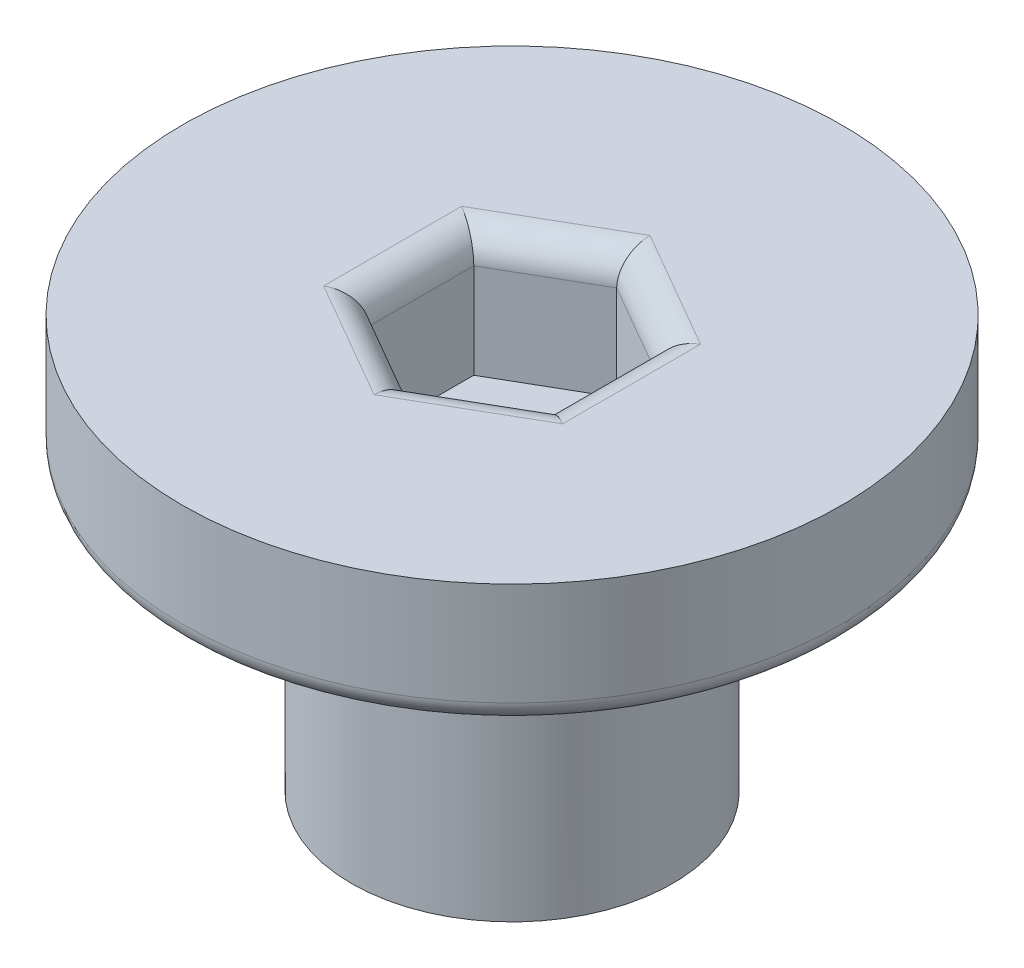
ISO-10303-21;
HEADER;
FILE_DESCRIPTION(('STEP AP214'),'2;1');
FILE_NAME('part.step','',(''),(''),'','','');
FILE_SCHEMA(('AUTOMOTIVE_DESIGN { 1 0 10303 214 1 1 1 1 }'));
ENDSEC;
DATA;
#1=APPLICATION_CONTEXT('core data for automotive mechanical design processes');
#2=APPLICATION_PROTOCOL_DEFINITION('international standard','automotive_design',2000,#1);
#3=PRODUCT_CONTEXT('',#1,'mechanical');
#4=PRODUCT('Part','Part','',(#3));
#5=PRODUCT_RELATED_PRODUCT_CATEGORY('part','',(#4));
#6=PRODUCT_DEFINITION_FORMATION('','',#4);
#7=PRODUCT_DEFINITION_CONTEXT('part definition',#1,'design');
#8=PRODUCT_DEFINITION('design','',#6,#7);
#9=PRODUCT_DEFINITION_SHAPE('','',#8);
#10=(LENGTH_UNIT() NAMED_UNIT(*) SI_UNIT(.MILLI.,.METRE.));
#11=(NAMED_UNIT(*) PLANE_ANGLE_UNIT() SI_UNIT($,.RADIAN.));
#12=(NAMED_UNIT(*) SI_UNIT($,.STERADIAN.) SOLID_ANGLE_UNIT());
#13=UNCERTAINTY_MEASURE_WITH_UNIT(LENGTH_MEASURE(1.E-05),#10,'distance_accuracy_value','');
#14=(GEOMETRIC_REPRESENTATION_CONTEXT(3) GLOBAL_UNCERTAINTY_ASSIGNED_CONTEXT((#13)) GLOBAL_UNIT_ASSIGNED_CONTEXT((#10,
#11,#12)) REPRESENTATION_CONTEXT('',''));
#15=CARTESIAN_POINT('',(0.,0.,0.));
#16=DIRECTION('',(0.,0.,1.));
#17=DIRECTION('',(1.,0.,0.));
#18=AXIS2_PLACEMENT_3D('',#15,#16,#17);
#19=CARTESIAN_POINT('',(0.,5.,0.));
#20=DIRECTION('',(0.,-1.,0.));
#21=DIRECTION('',(0.,0.,-1.));
#22=AXIS2_PLACEMENT_3D('',#19,#20,#21);
#23=CYLINDRICAL_SURFACE('',#22,1.15);
#24=CARTESIAN_POINT('',(0.,-6.5,0.));
#25=DIRECTION('',(0.,-1.,0.));
#26=DIRECTION('',(0.,0.,-1.));
#27=AXIS2_PLACEMENT_3D('',#24,#25,#26);
#28=CIRCLE('',#27,1.15);
#29=CARTESIAN_POINT('',(0.,-6.5,-1.15));
#30=VERTEX_POINT('',#29);
#31=EDGE_CURVE('E186',#30,#30,#28,.T.);
#32=ORIENTED_EDGE('',*,*,#31,.T.);
#33=EDGE_LOOP('',(#32));
#34=FACE_BOUND('',#33,.T.);
#35=CARTESIAN_POINT('',(0.,0.,0.));
#36=DIRECTION('',(0.,1.,0.));
#37=DIRECTION('',(0.,0.,1.));
#38=AXIS2_PLACEMENT_3D('',#35,#36,#37);
#39=CIRCLE('',#38,1.15);
#40=CARTESIAN_POINT('',(0.,0.,1.15));
#41=VERTEX_POINT('',#40);
#42=EDGE_CURVE('E143',#41,#41,#39,.F.);
#43=ORIENTED_EDGE('',*,*,#42,.F.);
#44=EDGE_LOOP('',(#43));
#45=FACE_BOUND('',#44,.T.);
#46=ADVANCED_FACE('F37',(#34,#45),#23,.F.);
#47=CARTESIAN_POINT('',(0.,3.,0.));
#48=DIRECTION('',(0.,-1.,0.));
#49=DIRECTION('',(0.,0.,-1.));
#50=AXIS2_PLACEMENT_3D('',#47,#48,#49);
#51=CYLINDRICAL_SURFACE('',#50,8.);
#52=CARTESIAN_POINT('',(0.,0.5,0.));
#53=DIRECTION('',(0.,1.,0.));
#54=DIRECTION('',(0.,0.,1.));
#55=AXIS2_PLACEMENT_3D('',#52,#53,#54);
#56=CIRCLE('',#55,8.);
#57=CARTESIAN_POINT('',(0.,0.5,8.));
#58=VERTEX_POINT('',#57);
#59=EDGE_CURVE('E204',#58,#58,#56,.T.);
#60=ORIENTED_EDGE('',*,*,#59,.T.);
#61=EDGE_LOOP('',(#60));
#62=FACE_BOUND('',#61,.T.);
#63=CARTESIAN_POINT('',(0.,3.,0.));
#64=DIRECTION('',(0.,1.,0.));
#65=DIRECTION('',(0.,0.,1.));
#66=AXIS2_PLACEMENT_3D('',#63,#64,#65);
#67=CIRCLE('',#66,8.);
#68=CARTESIAN_POINT('',(0.,3.,8.));
#69=VERTEX_POINT('',#68);
#70=EDGE_CURVE('E157',#69,#69,#67,.T.);
#71=ORIENTED_EDGE('',*,*,#70,.F.);
#72=EDGE_LOOP('',(#71));
#73=FACE_BOUND('',#72,.T.);
#74=ADVANCED_FACE('F221',(#62,#73),#51,.T.);
#75=CARTESIAN_POINT('',(0.,3.,0.));
#76=DIRECTION('',(0.,1.,0.));
#77=DIRECTION('',(0.,0.,1.));
#78=AXIS2_PLACEMENT_3D('',#75,#76,#77);
#79=PLANE('',#78);
#80=DIRECTION('',(-0.866025403784439,0.,-0.5));
#81=VECTOR('',#80,1.);
#82=CARTESIAN_POINT('',(2.55,3.,-1.87638837486629));
#83=LINE('',#82,#81);
#84=CARTESIAN_POINT('',(0.,3.,-3.34863156129983));
#85=VERTEX_POINT('',#84);
#86=CARTESIAN_POINT('',(2.9,3.,-1.67431578064992));
#87=VERTEX_POINT('',#86);
#88=EDGE_CURVE('E165',#85,#87,#83,.F.);
#89=ORIENTED_EDGE('',*,*,#88,.T.);
#90=DIRECTION('',(0.,0.,-1.));
#91=VECTOR('',#90,1.);
#92=CARTESIAN_POINT('',(2.9,3.,1.27017059221718));
#93=LINE('',#92,#91);
#94=CARTESIAN_POINT('',(2.9,3.,1.67431578064992));
#95=VERTEX_POINT('',#94);
#96=EDGE_CURVE('E175',#87,#95,#93,.F.);
#97=ORIENTED_EDGE('',*,*,#96,.T.);
#98=DIRECTION('',(0.866025403784439,0.,-0.5));
#99=VECTOR('',#98,1.);
#100=CARTESIAN_POINT('',(0.35,3.,3.14655896708346));
#101=LINE('',#100,#99);
#102=CARTESIAN_POINT('',(0.,3.,3.34863156129983));
#103=VERTEX_POINT('',#102);
#104=EDGE_CURVE('E173',#95,#103,#101,.F.);
#105=ORIENTED_EDGE('',*,*,#104,.T.);
#106=DIRECTION('',(0.866025403784439,0.,0.5));
#107=VECTOR('',#106,1.);
#108=CARTESIAN_POINT('',(-2.55,3.,1.87638837486628));
#109=LINE('',#108,#107);
#110=CARTESIAN_POINT('',(-2.9,3.,1.67431578064992));
#111=VERTEX_POINT('',#110);
#112=EDGE_CURVE('E171',#103,#111,#109,.F.);
#113=ORIENTED_EDGE('',*,*,#112,.T.);
#114=DIRECTION('',(0.,0.,1.));
#115=VECTOR('',#114,1.);
#116=CARTESIAN_POINT('',(-2.9,3.,-1.27017059221718));
#117=LINE('',#116,#115);
#118=CARTESIAN_POINT('',(-2.9,3.,-1.67431578064991));
#119=VERTEX_POINT('',#118);
#120=EDGE_CURVE('E169',#111,#119,#117,.F.);
#121=ORIENTED_EDGE('',*,*,#120,.T.);
#122=DIRECTION('',(-0.866025403784439,0.,0.5));
#123=VECTOR('',#122,1.);
#124=CARTESIAN_POINT('',(-0.350000000000001,3.,-3.14655896708346));
#125=LINE('',#124,#123);
#126=EDGE_CURVE('E167',#119,#85,#125,.F.);
#127=ORIENTED_EDGE('',*,*,#126,.T.);
#128=EDGE_LOOP('',(#89,#97,#105,#113,#121,#127));
#129=FACE_BOUND('',#128,.T.);
#130=ORIENTED_EDGE('',*,*,#70,.T.);
#131=EDGE_LOOP('',(#130));
#132=FACE_BOUND('',#131,.T.);
#133=ADVANCED_FACE('F224',(#129,#132),#79,.T.);
#134=CARTESIAN_POINT('',(0.,0.,0.));
#135=DIRECTION('',(0.,1.,0.));
#136=DIRECTION('',(0.,0.,1.));
#137=AXIS2_PLACEMENT_3D('',#134,#135,#136);
#138=PLANE('',#137);
#139=CARTESIAN_POINT('',(0.,0.,0.));
#140=DIRECTION('',(0.,1.,0.));
#141=DIRECTION('',(0.,0.,1.));
#142=AXIS2_PLACEMENT_3D('',#139,#140,#141);
#143=CIRCLE('',#142,7.5);
#144=CARTESIAN_POINT('',(0.,0.,7.5));
#145=VERTEX_POINT('',#144);
#146=EDGE_CURVE('E45',#145,#145,#143,.F.);
#147=ORIENTED_EDGE('',*,*,#146,.T.);
#148=EDGE_LOOP('',(#147));
#149=FACE_BOUND('',#148,.T.);
#150=CARTESIAN_POINT('',(0.,0.,0.));
#151=DIRECTION('',(0.,1.,0.));
#152=DIRECTION('',(0.,0.,1.));
#153=AXIS2_PLACEMENT_3D('',#150,#151,#152);
#154=CIRCLE('',#153,4.4);
#155=CARTESIAN_POINT('',(0.,0.,4.4));
#156=VERTEX_POINT('',#155);
#157=EDGE_CURVE('E207',#156,#156,#154,.T.);
#158=ORIENTED_EDGE('',*,*,#157,.T.);
#159=EDGE_LOOP('',(#158));
#160=FACE_BOUND('',#159,.T.);
#161=ADVANCED_FACE('F212',(#149,#160),#138,.F.);
#162=CARTESIAN_POINT('',(0.,-7.,0.));
#163=DIRECTION('',(0.,1.,0.));
#164=DIRECTION('',(0.,0.,1.));
#165=AXIS2_PLACEMENT_3D('',#162,#163,#164);
#166=CYLINDRICAL_SURFACE('',#165,3.9);
#167=CARTESIAN_POINT('',(0.,-0.5,0.));
#168=DIRECTION('',(0.,1.,0.));
#169=DIRECTION('',(0.,0.,1.));
#170=AXIS2_PLACEMENT_3D('',#167,#168,#169);
#171=CIRCLE('',#170,3.9);
#172=CARTESIAN_POINT('',(0.,-0.5,3.9));
#173=VERTEX_POINT('',#172);
#174=EDGE_CURVE('E11',#173,#173,#171,.F.);
#175=ORIENTED_EDGE('',*,*,#174,.T.);
#176=EDGE_LOOP('',(#175));
#177=FACE_BOUND('',#176,.T.);
#178=CARTESIAN_POINT('',(0.,-7.,0.));
#179=DIRECTION('',(0.,-1.,0.));
#180=DIRECTION('',(0.,0.,-1.));
#181=AXIS2_PLACEMENT_3D('',#178,#179,#180);
#182=CIRCLE('',#181,3.9);
#183=CARTESIAN_POINT('',(0.,-7.,-3.9));
#184=VERTEX_POINT('',#183);
#185=EDGE_CURVE('E154',#184,#184,#182,.T.);
#186=ORIENTED_EDGE('',*,*,#185,.F.);
#187=EDGE_LOOP('',(#186));
#188=FACE_BOUND('',#187,.T.);
#189=ADVANCED_FACE('F236',(#177,#188),#166,.T.);
#190=CARTESIAN_POINT('',(0.,-7.,0.));
#191=DIRECTION('',(0.,-1.,0.));
#192=DIRECTION('',(0.,0.,-1.));
#193=AXIS2_PLACEMENT_3D('',#190,#191,#192);
#194=PLANE('',#193);
#195=CARTESIAN_POINT('',(0.,-7.,0.));
#196=DIRECTION('',(0.,-1.,0.));
#197=DIRECTION('',(0.,0.,-1.));
#198=AXIS2_PLACEMENT_3D('',#195,#196,#197);
#199=CIRCLE('',#198,1.65);
#200=CARTESIAN_POINT('',(0.,-7.,-1.65));
#201=VERTEX_POINT('',#200);
#202=EDGE_CURVE('E201',#201,#201,#199,.F.);
#203=ORIENTED_EDGE('',*,*,#202,.T.);
#204=EDGE_LOOP('',(#203));
#205=FACE_BOUND('',#204,.T.);
#206=ORIENTED_EDGE('',*,*,#185,.T.);
#207=EDGE_LOOP('',(#206));
#208=FACE_BOUND('',#207,.T.);
#209=ADVANCED_FACE('F248',(#205,#208),#194,.T.);
#210=CARTESIAN_POINT('',(0.,0.,0.));
#211=DIRECTION('',(0.,1.,0.));
#212=DIRECTION('',(0.,0.,1.));
#213=AXIS2_PLACEMENT_3D('',#210,#211,#212);
#214=PLANE('',#213);
#215=DIRECTION('',(-0.866025403784439,0.,-0.5));
#216=VECTOR('',#215,1.);
#217=CARTESIAN_POINT('',(2.2,0.,-1.27017059221718));
#218=LINE('',#217,#216);
#219=CARTESIAN_POINT('',(2.2,0.,-1.27017059221718));
#220=VERTEX_POINT('',#219);
#221=CARTESIAN_POINT('',(0.,0.,-2.54034118443435));
#222=VERTEX_POINT('',#221);
#223=EDGE_CURVE('E111',#220,#222,#218,.T.);
#224=ORIENTED_EDGE('',*,*,#223,.T.);
#225=DIRECTION('',(-0.866025403784439,0.,0.5));
#226=VECTOR('',#225,1.);
#227=CARTESIAN_POINT('',(0.,0.,-2.54034118443435));
#228=LINE('',#227,#226);
#229=CARTESIAN_POINT('',(-2.2,0.,-1.27017059221718));
#230=VERTEX_POINT('',#229);
#231=EDGE_CURVE('E117',#222,#230,#228,.T.);
#232=ORIENTED_EDGE('',*,*,#231,.T.);
#233=DIRECTION('',(0.,0.,1.));
#234=VECTOR('',#233,1.);
#235=CARTESIAN_POINT('',(-2.2,0.,-1.27017059221718));
#236=LINE('',#235,#234);
#237=CARTESIAN_POINT('',(-2.2,0.,1.27017059221718));
#238=VERTEX_POINT('',#237);
#239=EDGE_CURVE('E122',#230,#238,#236,.T.);
#240=ORIENTED_EDGE('',*,*,#239,.T.);
#241=DIRECTION('',(0.866025403784439,0.,0.5));
#242=VECTOR('',#241,1.);
#243=CARTESIAN_POINT('',(-2.2,0.,1.27017059221718));
#244=LINE('',#243,#242);
#245=CARTESIAN_POINT('',(0.,0.,2.54034118443435));
#246=VERTEX_POINT('',#245);
#247=EDGE_CURVE('E135',#238,#246,#244,.T.);
#248=ORIENTED_EDGE('',*,*,#247,.T.);
#249=DIRECTION('',(0.866025403784439,0.,-0.5));
#250=VECTOR('',#249,1.);
#251=CARTESIAN_POINT('',(0.,0.,2.54034118443435));
#252=LINE('',#251,#250);
#253=CARTESIAN_POINT('',(2.2,0.,1.27017059221718));
#254=VERTEX_POINT('',#253);
#255=EDGE_CURVE('E138',#246,#254,#252,.T.);
#256=ORIENTED_EDGE('',*,*,#255,.T.);
#257=DIRECTION('',(0.,0.,-1.));
#258=VECTOR('',#257,1.);
#259=CARTESIAN_POINT('',(2.2,0.,1.27017059221718));
#260=LINE('',#259,#258);
#261=EDGE_CURVE('E114',#254,#220,#260,.T.);
#262=ORIENTED_EDGE('',*,*,#261,.T.);
#263=EDGE_LOOP('',(#224,#232,#240,#248,#256,#262));
#264=FACE_BOUND('',#263,.T.);
#265=ORIENTED_EDGE('',*,*,#42,.T.);
#266=EDGE_LOOP('',(#265));
#267=FACE_BOUND('',#266,.T.);
#268=ADVANCED_FACE('F124',(#264,#267),#214,.T.);
#269=CARTESIAN_POINT('',(2.2,0.,-1.27017059221718));
#270=DIRECTION('',(0.5,0.,-0.866025403784439));
#271=DIRECTION('',(-0.866025403784439,0.,-0.5));
#272=AXIS2_PLACEMENT_3D('',#269,#270,#271);
#273=PLANE('',#272);
#274=DIRECTION('',(0.,1.,0.));
#275=VECTOR('',#274,1.);
#276=CARTESIAN_POINT('',(2.2,0.,-1.27017059221718));
#277=LINE('',#276,#275);
#278=CARTESIAN_POINT('',(2.2,2.3,-1.27017059221718));
#279=VERTEX_POINT('',#278);
#280=EDGE_CURVE('E141',#220,#279,#277,.T.);
#281=ORIENTED_EDGE('',*,*,#280,.T.);
#282=DIRECTION('',(-0.866025403784439,0.,-0.5));
#283=VECTOR('',#282,1.);
#284=CARTESIAN_POINT('',(0.,2.3,-2.54034118443435));
#285=LINE('',#284,#283);
#286=CARTESIAN_POINT('',(0.,2.3,-2.54034118443435));
#287=VERTEX_POINT('',#286);
#288=EDGE_CURVE('E52',#279,#287,#285,.T.);
#289=ORIENTED_EDGE('',*,*,#288,.T.);
#290=DIRECTION('',(0.,1.,0.));
#291=VECTOR('',#290,1.);
#292=CARTESIAN_POINT('',(0.,0.,-2.54034118443435));
#293=LINE('',#292,#291);
#294=EDGE_CURVE('E107',#222,#287,#293,.T.);
#295=ORIENTED_EDGE('',*,*,#294,.F.);
#296=ORIENTED_EDGE('',*,*,#223,.F.);
#297=EDGE_LOOP('',(#281,#289,#295,#296));
#298=FACE_BOUND('',#297,.T.);
#299=ADVANCED_FACE('F109',(#298),#273,.F.);
#300=CARTESIAN_POINT('',(2.2,0.,1.27017059221718));
#301=DIRECTION('',(1.,0.,0.));
#302=DIRECTION('',(0.,0.,-1.));
#303=AXIS2_PLACEMENT_3D('',#300,#301,#302);
#304=PLANE('',#303);
#305=DIRECTION('',(0.,1.,0.));
#306=VECTOR('',#305,1.);
#307=CARTESIAN_POINT('',(2.2,0.,1.27017059221718));
#308=LINE('',#307,#306);
#309=CARTESIAN_POINT('',(2.2,2.3,1.27017059221718));
#310=VERTEX_POINT('',#309);
#311=EDGE_CURVE('E144',#254,#310,#308,.T.);
#312=ORIENTED_EDGE('',*,*,#311,.T.);
#313=DIRECTION('',(0.,0.,-1.));
#314=VECTOR('',#313,1.);
#315=CARTESIAN_POINT('',(2.2,2.3,-1.27017059221718));
#316=LINE('',#315,#314);
#317=EDGE_CURVE('E160',#310,#279,#316,.T.);
#318=ORIENTED_EDGE('',*,*,#317,.T.);
#319=ORIENTED_EDGE('',*,*,#280,.F.);
#320=ORIENTED_EDGE('',*,*,#261,.F.);
#321=EDGE_LOOP('',(#312,#318,#319,#320));
#322=FACE_BOUND('',#321,.T.);
#323=ADVANCED_FACE('F353',(#322),#304,.F.);
#324=CARTESIAN_POINT('',(0.,0.,2.54034118443435));
#325=DIRECTION('',(0.5,0.,0.866025403784439));
#326=DIRECTION('',(0.866025403784439,0.,-0.5));
#327=AXIS2_PLACEMENT_3D('',#324,#325,#326);
#328=PLANE('',#327);
#329=DIRECTION('',(0.,1.,0.));
#330=VECTOR('',#329,1.);
#331=CARTESIAN_POINT('',(0.,0.,2.54034118443435));
#332=LINE('',#331,#330);
#333=CARTESIAN_POINT('',(0.,2.3,2.54034118443435));
#334=VERTEX_POINT('',#333);
#335=EDGE_CURVE('E147',#246,#334,#332,.T.);
#336=ORIENTED_EDGE('',*,*,#335,.T.);
#337=DIRECTION('',(0.866025403784439,0.,-0.5));
#338=VECTOR('',#337,1.);
#339=CARTESIAN_POINT('',(2.2,2.3,1.27017059221718));
#340=LINE('',#339,#338);
#341=EDGE_CURVE('E178',#334,#310,#340,.T.);
#342=ORIENTED_EDGE('',*,*,#341,.T.);
#343=ORIENTED_EDGE('',*,*,#311,.F.);
#344=ORIENTED_EDGE('',*,*,#255,.F.);
#345=EDGE_LOOP('',(#336,#342,#343,#344));
#346=FACE_BOUND('',#345,.T.);
#347=ADVANCED_FACE('F345',(#346),#328,.F.);
#348=CARTESIAN_POINT('',(-2.2,0.,1.27017059221718));
#349=DIRECTION('',(-0.5,0.,0.866025403784439));
#350=DIRECTION('',(0.866025403784439,0.,0.5));
#351=AXIS2_PLACEMENT_3D('',#348,#349,#350);
#352=PLANE('',#351);
#353=DIRECTION('',(0.,1.,0.));
#354=VECTOR('',#353,1.);
#355=CARTESIAN_POINT('',(-2.2,0.,1.27017059221718));
#356=LINE('',#355,#354);
#357=CARTESIAN_POINT('',(-2.2,2.3,1.27017059221718));
#358=VERTEX_POINT('',#357);
#359=EDGE_CURVE('E150',#238,#358,#356,.T.);
#360=ORIENTED_EDGE('',*,*,#359,.T.);
#361=DIRECTION('',(0.866025403784439,0.,0.5));
#362=VECTOR('',#361,1.);
#363=CARTESIAN_POINT('',(0.,2.3,2.54034118443435));
#364=LINE('',#363,#362);
#365=EDGE_CURVE('E180',#358,#334,#364,.T.);
#366=ORIENTED_EDGE('',*,*,#365,.T.);
#367=ORIENTED_EDGE('',*,*,#335,.F.);
#368=ORIENTED_EDGE('',*,*,#247,.F.);
#369=EDGE_LOOP('',(#360,#366,#367,#368));
#370=FACE_BOUND('',#369,.T.);
#371=ADVANCED_FACE('F337',(#370),#352,.F.);
#372=CARTESIAN_POINT('',(-2.2,0.,-1.27017059221718));
#373=DIRECTION('',(-1.,0.,0.));
#374=DIRECTION('',(0.,0.,1.));
#375=AXIS2_PLACEMENT_3D('',#372,#373,#374);
#376=PLANE('',#375);
#377=DIRECTION('',(0.,1.,0.));
#378=VECTOR('',#377,1.);
#379=CARTESIAN_POINT('',(-2.2,0.,-1.27017059221718));
#380=LINE('',#379,#378);
#381=CARTESIAN_POINT('',(-2.2,2.3,-1.27017059221718));
#382=VERTEX_POINT('',#381);
#383=EDGE_CURVE('E113',#230,#382,#380,.T.);
#384=ORIENTED_EDGE('',*,*,#383,.T.);
#385=DIRECTION('',(0.,0.,1.));
#386=VECTOR('',#385,1.);
#387=CARTESIAN_POINT('',(-2.2,2.3,1.27017059221718));
#388=LINE('',#387,#386);
#389=EDGE_CURVE('E182',#382,#358,#388,.T.);
#390=ORIENTED_EDGE('',*,*,#389,.T.);
#391=ORIENTED_EDGE('',*,*,#359,.F.);
#392=ORIENTED_EDGE('',*,*,#239,.F.);
#393=EDGE_LOOP('',(#384,#390,#391,#392));
#394=FACE_BOUND('',#393,.T.);
#395=ADVANCED_FACE('F331',(#394),#376,.F.);
#396=CARTESIAN_POINT('',(0.,0.,-2.54034118443435));
#397=DIRECTION('',(-0.5,0.,-0.866025403784439));
#398=DIRECTION('',(-0.866025403784439,0.,0.5));
#399=AXIS2_PLACEMENT_3D('',#396,#397,#398);
#400=PLANE('',#399);
#401=ORIENTED_EDGE('',*,*,#294,.T.);
#402=DIRECTION('',(-0.866025403784439,0.,0.5));
#403=VECTOR('',#402,1.);
#404=CARTESIAN_POINT('',(-2.2,2.3,-1.27017059221718));
#405=LINE('',#404,#403);
#406=EDGE_CURVE('E59',#287,#382,#405,.T.);
#407=ORIENTED_EDGE('',*,*,#406,.T.);
#408=ORIENTED_EDGE('',*,*,#383,.F.);
#409=ORIENTED_EDGE('',*,*,#231,.F.);
#410=EDGE_LOOP('',(#401,#407,#408,#409));
#411=FACE_BOUND('',#410,.T.);
#412=ADVANCED_FACE('F118',(#411),#400,.F.);
#413=CARTESIAN_POINT('',(-2.9,2.3,-1.27017059221718));
#414=DIRECTION('',(0.,0.,-1.));
#415=DIRECTION('',(-1.,0.,0.));
#416=AXIS2_PLACEMENT_3D('',#413,#414,#415);
#417=CYLINDRICAL_SURFACE('',#416,0.7);
#418=CARTESIAN_POINT('',(-2.9,2.3,-1.67431578064991));
#419=DIRECTION('',(0.5,0.,-0.866025403784439));
#420=DIRECTION('',(-0.866025403784439,0.,-0.5));
#421=AXIS2_PLACEMENT_3D('',#418,#419,#420);
#422=ELLIPSE('',#421,0.808290376865476,0.7);
#423=EDGE_CURVE('E131',#119,#382,#422,.T.);
#424=ORIENTED_EDGE('',*,*,#423,.F.);
#425=ORIENTED_EDGE('',*,*,#120,.F.);
#426=CARTESIAN_POINT('',(-2.9,2.3,1.67431578064992));
#427=DIRECTION('',(-0.5,0.,-0.866025403784438));
#428=DIRECTION('',(-0.866025403784439,0.,0.5));
#429=AXIS2_PLACEMENT_3D('',#426,#427,#428);
#430=ELLIPSE('',#429,0.808290376865476,0.7);
#431=EDGE_CURVE('E128',#358,#111,#430,.F.);
#432=ORIENTED_EDGE('',*,*,#431,.F.);
#433=ORIENTED_EDGE('',*,*,#389,.F.);
#434=EDGE_LOOP('',(#424,#425,#432,#433));
#435=FACE_BOUND('',#434,.T.);
#436=ADVANCED_FACE('F316',(#435),#417,.T.);
#437=CARTESIAN_POINT('',(-2.55,2.3,1.87638837486628));
#438=DIRECTION('',(-0.866025403784439,0.,-0.5));
#439=DIRECTION('',(-0.5,0.,0.866025403784439));
#440=AXIS2_PLACEMENT_3D('',#437,#438,#439);
#441=CYLINDRICAL_SURFACE('',#440,0.7);
#442=ORIENTED_EDGE('',*,*,#431,.T.);
#443=ORIENTED_EDGE('',*,*,#112,.F.);
#444=CARTESIAN_POINT('',(0.,2.3,3.34863156129983));
#445=DIRECTION('',(-1.,0.,0.));
#446=DIRECTION('',(0.,0.,1.));
#447=AXIS2_PLACEMENT_3D('',#444,#445,#446);
#448=ELLIPSE('',#447,0.808290376865476,0.7);
#449=EDGE_CURVE('E194',#334,#103,#448,.F.);
#450=ORIENTED_EDGE('',*,*,#449,.F.);
#451=ORIENTED_EDGE('',*,*,#365,.F.);
#452=EDGE_LOOP('',(#442,#443,#450,#451));
#453=FACE_BOUND('',#452,.T.);
#454=ADVANCED_FACE('F308',(#453),#441,.T.);
#455=CARTESIAN_POINT('',(-0.35,2.3,-3.14655896708346));
#456=DIRECTION('',(0.866025403784439,0.,-0.5));
#457=DIRECTION('',(-0.5,0.,-0.866025403784439));
#458=AXIS2_PLACEMENT_3D('',#455,#456,#457);
#459=CYLINDRICAL_SURFACE('',#458,0.7);
#460=ORIENTED_EDGE('',*,*,#423,.T.);
#461=ORIENTED_EDGE('',*,*,#406,.F.);
#462=CARTESIAN_POINT('',(0.,2.3,-3.34863156129983));
#463=DIRECTION('',(1.,0.,0.));
#464=DIRECTION('',(0.,0.,-1.));
#465=AXIS2_PLACEMENT_3D('',#462,#463,#464);
#466=ELLIPSE('',#465,0.808290376865476,0.7);
#467=EDGE_CURVE('E191',#85,#287,#466,.T.);
#468=ORIENTED_EDGE('',*,*,#467,.F.);
#469=ORIENTED_EDGE('',*,*,#126,.F.);
#470=EDGE_LOOP('',(#460,#461,#468,#469));
#471=FACE_BOUND('',#470,.T.);
#472=ADVANCED_FACE('F300',(#471),#459,.T.);
#473=CARTESIAN_POINT('',(0.35,2.3,3.14655896708346));
#474=DIRECTION('',(-0.866025403784439,0.,0.5));
#475=DIRECTION('',(0.5,0.,0.866025403784439));
#476=AXIS2_PLACEMENT_3D('',#473,#474,#475);
#477=CYLINDRICAL_SURFACE('',#476,0.7);
#478=ORIENTED_EDGE('',*,*,#449,.T.);
#479=ORIENTED_EDGE('',*,*,#104,.F.);
#480=CARTESIAN_POINT('',(2.9,2.3,1.67431578064991));
#481=DIRECTION('',(-0.5,0.,0.866025403784439));
#482=DIRECTION('',(0.866025403784439,0.,0.5));
#483=AXIS2_PLACEMENT_3D('',#480,#481,#482);
#484=ELLIPSE('',#483,0.808290376865476,0.7);
#485=EDGE_CURVE('E189',#310,#95,#484,.F.);
#486=ORIENTED_EDGE('',*,*,#485,.F.);
#487=ORIENTED_EDGE('',*,*,#341,.F.);
#488=EDGE_LOOP('',(#478,#479,#486,#487));
#489=FACE_BOUND('',#488,.T.);
#490=ADVANCED_FACE('F292',(#489),#477,.T.);
#491=CARTESIAN_POINT('',(2.55,2.3,-1.87638837486629));
#492=DIRECTION('',(0.866025403784439,0.,0.5));
#493=DIRECTION('',(0.5,0.,-0.866025403784439));
#494=AXIS2_PLACEMENT_3D('',#491,#492,#493);
#495=CYLINDRICAL_SURFACE('',#494,0.7);
#496=ORIENTED_EDGE('',*,*,#467,.T.);
#497=ORIENTED_EDGE('',*,*,#288,.F.);
#498=CARTESIAN_POINT('',(2.9,2.3,-1.67431578064992));
#499=DIRECTION('',(0.5,0.,0.866025403784438));
#500=DIRECTION('',(-0.866025403784438,0.,0.5));
#501=AXIS2_PLACEMENT_3D('',#498,#499,#500);
#502=ELLIPSE('',#501,0.808290376865476,0.7);
#503=EDGE_CURVE('E187',#87,#279,#502,.T.);
#504=ORIENTED_EDGE('',*,*,#503,.F.);
#505=ORIENTED_EDGE('',*,*,#88,.F.);
#506=EDGE_LOOP('',(#496,#497,#504,#505));
#507=FACE_BOUND('',#506,.T.);
#508=ADVANCED_FACE('F284',(#507),#495,.T.);
#509=CARTESIAN_POINT('',(2.9,2.3,1.27017059221718));
#510=DIRECTION('',(0.,0.,1.));
#511=DIRECTION('',(1.,0.,0.));
#512=AXIS2_PLACEMENT_3D('',#509,#510,#511);
#513=CYLINDRICAL_SURFACE('',#512,0.7);
#514=ORIENTED_EDGE('',*,*,#485,.T.);
#515=ORIENTED_EDGE('',*,*,#96,.F.);
#516=ORIENTED_EDGE('',*,*,#503,.T.);
#517=ORIENTED_EDGE('',*,*,#317,.F.);
#518=EDGE_LOOP('',(#514,#515,#516,#517));
#519=FACE_BOUND('',#518,.T.);
#520=ADVANCED_FACE('F275',(#519),#513,.T.);
#521=CARTESIAN_POINT('',(0.,-6.5,0.));
#522=DIRECTION('',(0.,-1.,0.));
#523=DIRECTION('',(0.,0.,-1.));
#524=AXIS2_PLACEMENT_3D('',#521,#522,#523);
#525=TOROIDAL_SURFACE('',#524,1.65,0.5);
#526=ORIENTED_EDGE('',*,*,#202,.F.);
#527=EDGE_LOOP('',(#526));
#528=FACE_BOUND('',#527,.T.);
#529=ORIENTED_EDGE('',*,*,#31,.F.);
#530=EDGE_LOOP('',(#529));
#531=FACE_BOUND('',#530,.T.);
#532=ADVANCED_FACE('F218',(#528,#531),#525,.T.);
#533=CARTESIAN_POINT('',(0.,0.5,0.));
#534=DIRECTION('',(0.,1.,0.));
#535=DIRECTION('',(0.,0.,1.));
#536=AXIS2_PLACEMENT_3D('',#533,#534,#535);
#537=TOROIDAL_SURFACE('',#536,7.5,0.5);
#538=ORIENTED_EDGE('',*,*,#146,.F.);
#539=EDGE_LOOP('',(#538));
#540=FACE_BOUND('',#539,.T.);
#541=ORIENTED_EDGE('',*,*,#59,.F.);
#542=EDGE_LOOP('',(#541));
#543=FACE_BOUND('',#542,.T.);
#544=ADVANCED_FACE('F215',(#540,#543),#537,.T.);
#545=CARTESIAN_POINT('',(0.,-0.5,0.));
#546=DIRECTION('',(0.,1.,0.));
#547=DIRECTION('',(0.,0.,1.));
#548=AXIS2_PLACEMENT_3D('',#545,#546,#547);
#549=TOROIDAL_SURFACE('',#548,4.4,0.5);
#550=ORIENTED_EDGE('',*,*,#157,.F.);
#551=EDGE_LOOP('',(#550));
#552=FACE_BOUND('',#551,.T.);
#553=ORIENTED_EDGE('',*,*,#174,.F.);
#554=EDGE_LOOP('',(#553));
#555=FACE_BOUND('',#554,.T.);
#556=ADVANCED_FACE('F39',(#552,#555),#549,.F.);
#557=CLOSED_SHELL('',(#46,#74,#133,#161,#189,#209,#268,#299,#323,#347,#371,#395,#412,#436,#454,
#472,#490,#508,#520,#532,#544,#556));
#558=MANIFOLD_SOLID_BREP('B2',#557);
#559=ADVANCED_BREP_SHAPE_REPRESENTATION('',(#18,#558),#14);
#560=SHAPE_DEFINITION_REPRESENTATION(#9,#559);
ENDSEC;
END-ISO-10303-21;
